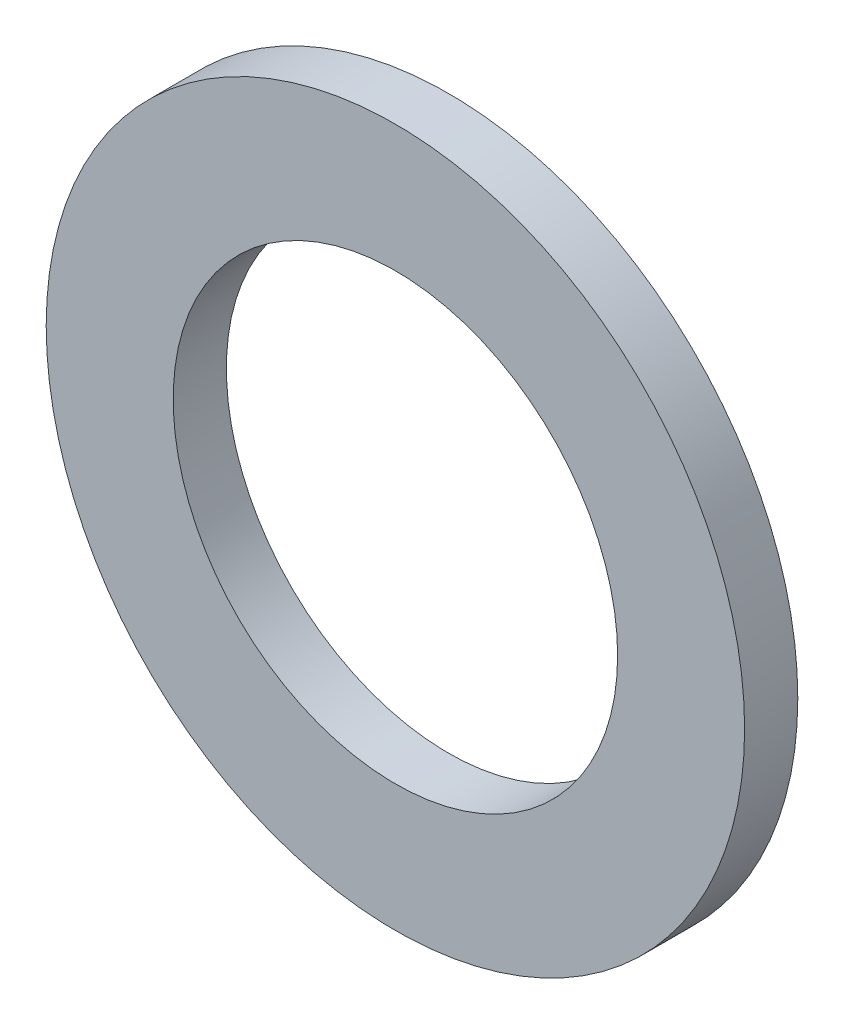
ISO-10303-21;
HEADER;
FILE_DESCRIPTION(('STEP AP214'),'2;1');
FILE_NAME('part.step','',(''),(''),'','','');
FILE_SCHEMA(('AUTOMOTIVE_DESIGN { 1 0 10303 214 1 1 1 1 }'));
ENDSEC;
DATA;
#1=APPLICATION_CONTEXT('core data for automotive mechanical design processes');
#2=APPLICATION_PROTOCOL_DEFINITION('international standard','automotive_design',2000,#1);
#3=PRODUCT_CONTEXT('',#1,'mechanical');
#4=PRODUCT('Part','Part','',(#3));
#5=PRODUCT_RELATED_PRODUCT_CATEGORY('part','',(#4));
#6=PRODUCT_DEFINITION_FORMATION('','',#4);
#7=PRODUCT_DEFINITION_CONTEXT('part definition',#1,'design');
#8=PRODUCT_DEFINITION('design','',#6,#7);
#9=PRODUCT_DEFINITION_SHAPE('','',#8);
#10=(LENGTH_UNIT() NAMED_UNIT(*) SI_UNIT(.MILLI.,.METRE.));
#11=(NAMED_UNIT(*) PLANE_ANGLE_UNIT() SI_UNIT($,.RADIAN.));
#12=(NAMED_UNIT(*) SI_UNIT($,.STERADIAN.) SOLID_ANGLE_UNIT());
#13=UNCERTAINTY_MEASURE_WITH_UNIT(LENGTH_MEASURE(1.E-05),#10,'distance_accuracy_value','');
#14=(GEOMETRIC_REPRESENTATION_CONTEXT(3) GLOBAL_UNCERTAINTY_ASSIGNED_CONTEXT((#13)) GLOBAL_UNIT_ASSIGNED_CONTEXT((#10,
#11,#12)) REPRESENTATION_CONTEXT('',''));
#15=CARTESIAN_POINT('',(0.,0.,0.));
#16=DIRECTION('',(0.,0.,1.));
#17=DIRECTION('',(1.,0.,0.));
#18=AXIS2_PLACEMENT_3D('',#15,#16,#17);
#19=CARTESIAN_POINT('',(0.,0.,3.35));
#20=DIRECTION('',(0.,0.,1.));
#21=DIRECTION('',(1.,0.,0.));
#22=AXIS2_PLACEMENT_3D('',#19,#20,#21);
#23=PLANE('',#22);
#24=CARTESIAN_POINT('',(0.,0.,3.35));
#25=DIRECTION('',(0.,0.,1.));
#26=DIRECTION('',(1.,0.,0.));
#27=AXIS2_PLACEMENT_3D('',#24,#25,#26);
#28=CIRCLE('',#27,22.);
#29=CARTESIAN_POINT('',(22.,0.,3.35));
#30=VERTEX_POINT('',#29);
#31=EDGE_CURVE('E11',#30,#30,#28,.T.);
#32=ORIENTED_EDGE('',*,*,#31,.T.);
#33=EDGE_LOOP('',(#32));
#34=FACE_BOUND('',#33,.T.);
#35=CARTESIAN_POINT('',(0.,0.,3.35));
#36=DIRECTION('',(0.,0.,1.));
#37=DIRECTION('',(1.,0.,0.));
#38=AXIS2_PLACEMENT_3D('',#35,#36,#37);
#39=CIRCLE('',#38,14.);
#40=CARTESIAN_POINT('',(14.,0.,3.35));
#41=VERTEX_POINT('',#40);
#42=EDGE_CURVE('E56',#41,#41,#39,.T.);
#43=ORIENTED_EDGE('',*,*,#42,.F.);
#44=EDGE_LOOP('',(#43));
#45=FACE_BOUND('',#44,.T.);
#46=ADVANCED_FACE('F43',(#34,#45),#23,.T.);
#47=CARTESIAN_POINT('',(0.,0.,0.));
#48=DIRECTION('',(0.,0.,1.));
#49=DIRECTION('',(1.,0.,0.));
#50=AXIS2_PLACEMENT_3D('',#47,#48,#49);
#51=PLANE('',#50);
#52=CARTESIAN_POINT('',(0.,0.,0.));
#53=DIRECTION('',(0.,0.,1.));
#54=DIRECTION('',(1.,0.,0.));
#55=AXIS2_PLACEMENT_3D('',#52,#53,#54);
#56=CIRCLE('',#55,22.);
#57=CARTESIAN_POINT('',(22.,0.,0.));
#58=VERTEX_POINT('',#57);
#59=EDGE_CURVE('E47',#58,#58,#56,.T.);
#60=ORIENTED_EDGE('',*,*,#59,.F.);
#61=EDGE_LOOP('',(#60));
#62=FACE_BOUND('',#61,.T.);
#63=CARTESIAN_POINT('',(0.,0.,0.));
#64=DIRECTION('',(0.,0.,1.));
#65=DIRECTION('',(1.,0.,0.));
#66=AXIS2_PLACEMENT_3D('',#63,#64,#65);
#67=CIRCLE('',#66,14.);
#68=CARTESIAN_POINT('',(14.,0.,0.));
#69=VERTEX_POINT('',#68);
#70=EDGE_CURVE('E58',#69,#69,#67,.T.);
#71=ORIENTED_EDGE('',*,*,#70,.T.);
#72=EDGE_LOOP('',(#71));
#73=FACE_BOUND('',#72,.T.);
#74=ADVANCED_FACE('F70',(#62,#73),#51,.F.);
#75=CARTESIAN_POINT('',(0.,0.,3.35));
#76=DIRECTION('',(0.,0.,-1.));
#77=DIRECTION('',(-1.,0.,0.));
#78=AXIS2_PLACEMENT_3D('',#75,#76,#77);
#79=CYLINDRICAL_SURFACE('',#78,22.);
#80=ORIENTED_EDGE('',*,*,#31,.F.);
#81=EDGE_LOOP('',(#80));
#82=FACE_BOUND('',#81,.T.);
#83=ORIENTED_EDGE('',*,*,#59,.T.);
#84=EDGE_LOOP('',(#83));
#85=FACE_BOUND('',#84,.T.);
#86=ADVANCED_FACE('F45',(#82,#85),#79,.T.);
#87=CARTESIAN_POINT('',(0.,0.,3.35));
#88=DIRECTION('',(0.,0.,-1.));
#89=DIRECTION('',(-1.,0.,0.));
#90=AXIS2_PLACEMENT_3D('',#87,#88,#89);
#91=CYLINDRICAL_SURFACE('',#90,14.);
#92=ORIENTED_EDGE('',*,*,#42,.T.);
#93=EDGE_LOOP('',(#92));
#94=FACE_BOUND('',#93,.T.);
#95=ORIENTED_EDGE('',*,*,#70,.F.);
#96=EDGE_LOOP('',(#95));
#97=FACE_BOUND('',#96,.T.);
#98=ADVANCED_FACE('F66',(#94,#97),#91,.F.);
#99=CLOSED_SHELL('',(#46,#74,#86,#98));
#100=MANIFOLD_SOLID_BREP('B2',#99);
#101=ADVANCED_BREP_SHAPE_REPRESENTATION('',(#18,#100),#14);
#102=SHAPE_DEFINITION_REPRESENTATION(#9,#101);
ENDSEC;
END-ISO-10303-21;
